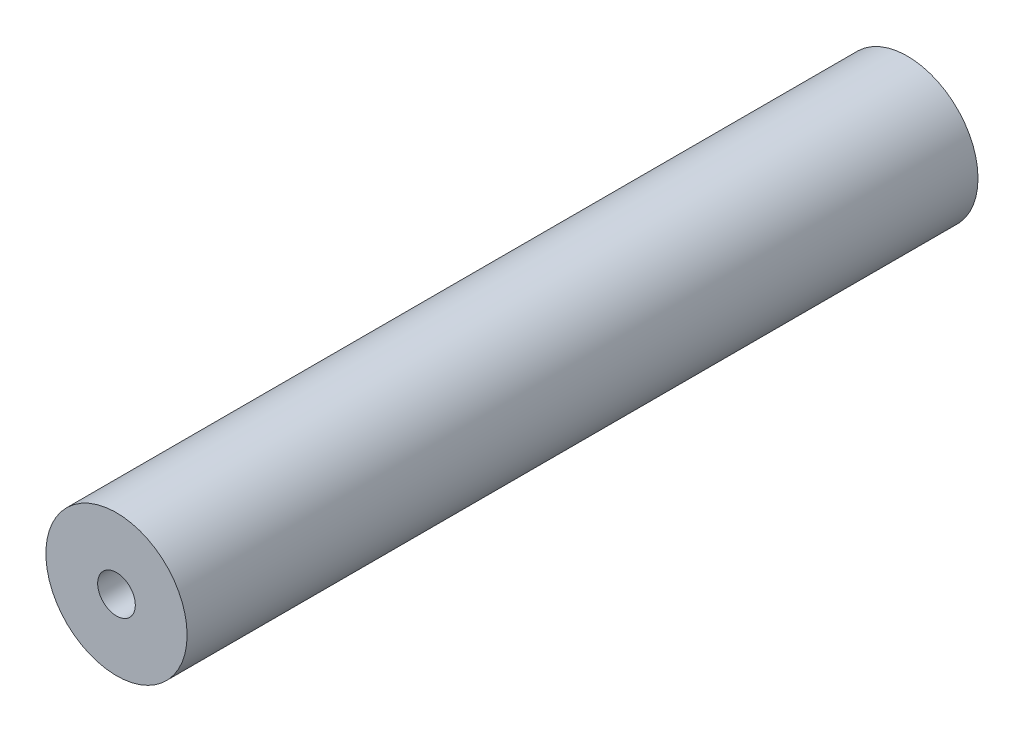
ISO-10303-21;
HEADER;
FILE_DESCRIPTION(('STEP AP214'),'2;1');
FILE_NAME('part.step','',(''),(''),'','','');
FILE_SCHEMA(('AUTOMOTIVE_DESIGN { 1 0 10303 214 1 1 1 1 }'));
ENDSEC;
DATA;
#1=APPLICATION_CONTEXT('core data for automotive mechanical design processes');
#2=APPLICATION_PROTOCOL_DEFINITION('international standard','automotive_design',2000,#1);
#3=PRODUCT_CONTEXT('',#1,'mechanical');
#4=PRODUCT('Part','Part','',(#3));
#5=PRODUCT_RELATED_PRODUCT_CATEGORY('part','',(#4));
#6=PRODUCT_DEFINITION_FORMATION('','',#4);
#7=PRODUCT_DEFINITION_CONTEXT('part definition',#1,'design');
#8=PRODUCT_DEFINITION('design','',#6,#7);
#9=PRODUCT_DEFINITION_SHAPE('','',#8);
#10=(LENGTH_UNIT() NAMED_UNIT(*) SI_UNIT(.MILLI.,.METRE.));
#11=(NAMED_UNIT(*) PLANE_ANGLE_UNIT() SI_UNIT($,.RADIAN.));
#12=(NAMED_UNIT(*) SI_UNIT($,.STERADIAN.) SOLID_ANGLE_UNIT());
#13=UNCERTAINTY_MEASURE_WITH_UNIT(LENGTH_MEASURE(1.E-05),#10,'distance_accuracy_value','');
#14=(GEOMETRIC_REPRESENTATION_CONTEXT(3) GLOBAL_UNCERTAINTY_ASSIGNED_CONTEXT((#13)) GLOBAL_UNIT_ASSIGNED_CONTEXT((#10,
#11,#12)) REPRESENTATION_CONTEXT('',''));
#15=CARTESIAN_POINT('',(0.,0.,0.));
#16=DIRECTION('',(0.,0.,1.));
#17=DIRECTION('',(1.,0.,0.));
#18=AXIS2_PLACEMENT_3D('',#15,#16,#17);
#19=CARTESIAN_POINT('',(0.,0.,105.));
#20=DIRECTION('',(0.,0.,-1.));
#21=DIRECTION('',(-1.,0.,0.));
#22=AXIS2_PLACEMENT_3D('',#19,#20,#21);
#23=CYLINDRICAL_SURFACE('',#22,9.375);
#24=CARTESIAN_POINT('',(0.,0.,105.));
#25=DIRECTION('',(0.,0.,1.));
#26=DIRECTION('',(1.,0.,0.));
#27=AXIS2_PLACEMENT_3D('',#24,#25,#26);
#28=CIRCLE('',#27,9.375);
#29=CARTESIAN_POINT('',(9.375,0.,105.));
#30=VERTEX_POINT('',#29);
#31=EDGE_CURVE('E10',#30,#30,#28,.T.);
#32=ORIENTED_EDGE('',*,*,#31,.F.);
#33=EDGE_LOOP('',(#32));
#34=FACE_BOUND('',#33,.T.);
#35=CARTESIAN_POINT('',(0.,0.,0.));
#36=DIRECTION('',(0.,0.,1.));
#37=DIRECTION('',(1.,0.,0.));
#38=AXIS2_PLACEMENT_3D('',#35,#36,#37);
#39=CIRCLE('',#38,9.375);
#40=CARTESIAN_POINT('',(9.375,0.,0.));
#41=VERTEX_POINT('',#40);
#42=EDGE_CURVE('E34',#41,#41,#39,.T.);
#43=ORIENTED_EDGE('',*,*,#42,.T.);
#44=EDGE_LOOP('',(#43));
#45=FACE_BOUND('',#44,.T.);
#46=ADVANCED_FACE('F31',(#34,#45),#23,.T.);
#47=CARTESIAN_POINT('',(0.,0.,105.));
#48=DIRECTION('',(0.,0.,1.));
#49=DIRECTION('',(1.,0.,0.));
#50=AXIS2_PLACEMENT_3D('',#47,#48,#49);
#51=PLANE('',#50);
#52=CARTESIAN_POINT('',(0.,0.,105.));
#53=DIRECTION('',(0.,0.,1.));
#54=DIRECTION('',(1.,0.,0.));
#55=AXIS2_PLACEMENT_3D('',#52,#53,#54);
#56=CIRCLE('',#55,2.5);
#57=CARTESIAN_POINT('',(2.5,0.,105.));
#58=VERTEX_POINT('',#57);
#59=EDGE_CURVE('E43',#58,#58,#56,.T.);
#60=ORIENTED_EDGE('',*,*,#59,.F.);
#61=EDGE_LOOP('',(#60));
#62=FACE_BOUND('',#61,.T.);
#63=ORIENTED_EDGE('',*,*,#31,.T.);
#64=EDGE_LOOP('',(#63));
#65=FACE_BOUND('',#64,.T.);
#66=ADVANCED_FACE('F67',(#62,#65),#51,.T.);
#67=CARTESIAN_POINT('',(0.,0.,0.));
#68=DIRECTION('',(0.,0.,1.));
#69=DIRECTION('',(1.,0.,0.));
#70=AXIS2_PLACEMENT_3D('',#67,#68,#69);
#71=PLANE('',#70);
#72=CARTESIAN_POINT('',(0.,0.,0.));
#73=DIRECTION('',(0.,0.,1.));
#74=DIRECTION('',(1.,0.,0.));
#75=AXIS2_PLACEMENT_3D('',#72,#73,#74);
#76=CIRCLE('',#75,2.5);
#77=CARTESIAN_POINT('',(2.5,0.,0.));
#78=VERTEX_POINT('',#77);
#79=EDGE_CURVE('E49',#78,#78,#76,.T.);
#80=ORIENTED_EDGE('',*,*,#79,.T.);
#81=EDGE_LOOP('',(#80));
#82=FACE_BOUND('',#81,.T.);
#83=ORIENTED_EDGE('',*,*,#42,.F.);
#84=EDGE_LOOP('',(#83));
#85=FACE_BOUND('',#84,.T.);
#86=ADVANCED_FACE('F72',(#82,#85),#71,.F.);
#87=CARTESIAN_POINT('',(0.,0.,85.));
#88=DIRECTION('',(0.,0.,1.));
#89=DIRECTION('',(1.,0.,0.));
#90=AXIS2_PLACEMENT_3D('',#87,#88,#89);
#91=CYLINDRICAL_SURFACE('',#90,2.5);
#92=CARTESIAN_POINT('',(0.,0.,85.));
#93=DIRECTION('',(0.,0.,1.));
#94=DIRECTION('',(1.,0.,0.));
#95=AXIS2_PLACEMENT_3D('',#92,#93,#94);
#96=CIRCLE('',#95,2.5);
#97=CARTESIAN_POINT('',(2.5,0.,85.));
#98=VERTEX_POINT('',#97);
#99=EDGE_CURVE('E41',#98,#98,#96,.T.);
#100=ORIENTED_EDGE('',*,*,#99,.F.);
#101=EDGE_LOOP('',(#100));
#102=FACE_BOUND('',#101,.T.);
#103=ORIENTED_EDGE('',*,*,#59,.T.);
#104=EDGE_LOOP('',(#103));
#105=FACE_BOUND('',#104,.T.);
#106=ADVANCED_FACE('F79',(#102,#105),#91,.F.);
#107=CARTESIAN_POINT('',(0.,0.,85.));
#108=DIRECTION('',(0.,0.,1.));
#109=DIRECTION('',(1.,0.,0.));
#110=AXIS2_PLACEMENT_3D('',#107,#108,#109);
#111=PLANE('',#110);
#112=ORIENTED_EDGE('',*,*,#99,.T.);
#113=EDGE_LOOP('',(#112));
#114=FACE_BOUND('',#113,.T.);
#115=ADVANCED_FACE('F64',(#114),#111,.T.);
#116=CARTESIAN_POINT('',(0.,0.,20.));
#117=DIRECTION('',(0.,0.,-1.));
#118=DIRECTION('',(-1.,0.,0.));
#119=AXIS2_PLACEMENT_3D('',#116,#117,#118);
#120=CYLINDRICAL_SURFACE('',#119,2.5);
#121=CARTESIAN_POINT('',(0.,0.,20.));
#122=DIRECTION('',(0.,0.,1.));
#123=DIRECTION('',(1.,0.,0.));
#124=AXIS2_PLACEMENT_3D('',#121,#122,#123);
#125=CIRCLE('',#124,2.5);
#126=CARTESIAN_POINT('',(2.5,0.,20.));
#127=VERTEX_POINT('',#126);
#128=EDGE_CURVE('E46',#127,#127,#125,.T.);
#129=ORIENTED_EDGE('',*,*,#128,.T.);
#130=EDGE_LOOP('',(#129));
#131=FACE_BOUND('',#130,.T.);
#132=ORIENTED_EDGE('',*,*,#79,.F.);
#133=EDGE_LOOP('',(#132));
#134=FACE_BOUND('',#133,.T.);
#135=ADVANCED_FACE('F55',(#131,#134),#120,.F.);
#136=CARTESIAN_POINT('',(0.,0.,20.));
#137=DIRECTION('',(0.,0.,-1.));
#138=DIRECTION('',(1.,0.,0.));
#139=AXIS2_PLACEMENT_3D('',#136,#137,#138);
#140=PLANE('',#139);
#141=ORIENTED_EDGE('',*,*,#128,.F.);
#142=EDGE_LOOP('',(#141));
#143=FACE_BOUND('',#142,.T.);
#144=ADVANCED_FACE('F58',(#143),#140,.T.);
#145=CLOSED_SHELL('',(#46,#66,#86,#106,#115,#135,#144));
#146=MANIFOLD_SOLID_BREP('B2',#145);
#147=ADVANCED_BREP_SHAPE_REPRESENTATION('',(#18,#146),#14);
#148=SHAPE_DEFINITION_REPRESENTATION(#9,#147);
ENDSEC;
END-ISO-10303-21;
